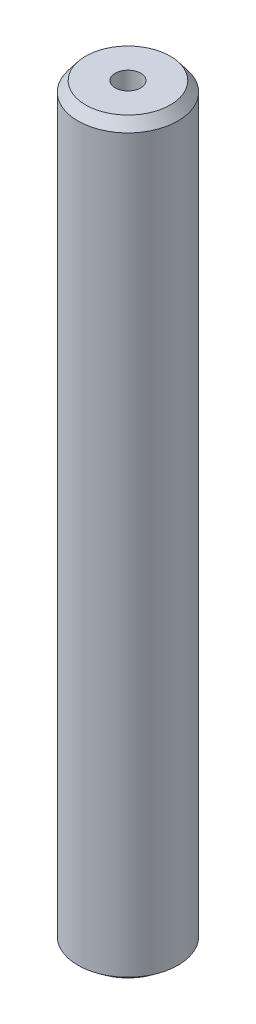
ISO-10303-21;
HEADER;
FILE_DESCRIPTION(('STEP AP214'),'2;1');
FILE_NAME('part.step','',(''),(''),'','','');
FILE_SCHEMA(('AUTOMOTIVE_DESIGN { 1 0 10303 214 1 1 1 1 }'));
ENDSEC;
DATA;
#1=APPLICATION_CONTEXT('core data for automotive mechanical design processes');
#2=APPLICATION_PROTOCOL_DEFINITION('international standard','automotive_design',2000,#1);
#3=PRODUCT_CONTEXT('',#1,'mechanical');
#4=PRODUCT('Part','Part','',(#3));
#5=PRODUCT_RELATED_PRODUCT_CATEGORY('part','',(#4));
#6=PRODUCT_DEFINITION_FORMATION('','',#4);
#7=PRODUCT_DEFINITION_CONTEXT('part definition',#1,'design');
#8=PRODUCT_DEFINITION('design','',#6,#7);
#9=PRODUCT_DEFINITION_SHAPE('','',#8);
#10=(LENGTH_UNIT() NAMED_UNIT(*) SI_UNIT(.MILLI.,.METRE.));
#11=(NAMED_UNIT(*) PLANE_ANGLE_UNIT() SI_UNIT($,.RADIAN.));
#12=(NAMED_UNIT(*) SI_UNIT($,.STERADIAN.) SOLID_ANGLE_UNIT());
#13=UNCERTAINTY_MEASURE_WITH_UNIT(LENGTH_MEASURE(1.E-05),#10,'distance_accuracy_value','');
#14=(GEOMETRIC_REPRESENTATION_CONTEXT(3) GLOBAL_UNCERTAINTY_ASSIGNED_CONTEXT((#13)) GLOBAL_UNIT_ASSIGNED_CONTEXT((#10,
#11,#12)) REPRESENTATION_CONTEXT('',''));
#15=CARTESIAN_POINT('',(0.,0.,0.));
#16=DIRECTION('',(0.,0.,1.));
#17=DIRECTION('',(1.,0.,0.));
#18=AXIS2_PLACEMENT_3D('',#15,#16,#17);
#19=CARTESIAN_POINT('',(0.,74.8394640277143,0.));
#20=DIRECTION('',(0.,-1.,0.));
#21=DIRECTION('',(0.,0.,-1.));
#22=AXIS2_PLACEMENT_3D('',#19,#20,#21);
#23=CYLINDRICAL_SURFACE('',#22,5.);
#24=CARTESIAN_POINT('',(0.,73.8399286942285,0.));
#25=DIRECTION('',(0.,1.,0.));
#26=DIRECTION('',(0.,0.,1.));
#27=AXIS2_PLACEMENT_3D('',#24,#25,#26);
#28=CIRCLE('',#27,5.);
#29=CARTESIAN_POINT('',(0.,73.8399286942285,5.));
#30=VERTEX_POINT('',#29);
#31=EDGE_CURVE('E50',#30,#30,#28,.F.);
#32=ORIENTED_EDGE('',*,*,#31,.T.);
#33=EDGE_LOOP('',(#32));
#34=FACE_BOUND('',#33,.T.);
#35=CARTESIAN_POINT('',(0.,0.771965312745551,0.));
#36=DIRECTION('',(0.,1.,0.));
#37=DIRECTION('',(0.,0.,1.));
#38=AXIS2_PLACEMENT_3D('',#35,#36,#37);
#39=CIRCLE('',#38,5.);
#40=CARTESIAN_POINT('',(0.,0.771965312745551,5.));
#41=VERTEX_POINT('',#40);
#42=EDGE_CURVE('E51',#41,#41,#39,.T.);
#43=ORIENTED_EDGE('',*,*,#42,.T.);
#44=EDGE_LOOP('',(#43));
#45=FACE_BOUND('',#44,.T.);
#46=ADVANCED_FACE('F39',(#34,#45),#23,.T.);
#47=CARTESIAN_POINT('',(0.,74.8394640277143,0.));
#48=DIRECTION('',(0.,1.,0.));
#49=DIRECTION('',(0.,0.,1.));
#50=AXIS2_PLACEMENT_3D('',#47,#48,#49);
#51=PLANE('',#50);
#52=CARTESIAN_POINT('',(0.,74.8394640277143,0.));
#53=DIRECTION('',(0.,1.,0.));
#54=DIRECTION('',(0.,0.,1.));
#55=AXIS2_PLACEMENT_3D('',#52,#53,#54);
#56=CIRCLE('',#55,4.22803468725446);
#57=CARTESIAN_POINT('',(0.,74.8394640277143,4.22803468725446));
#58=VERTEX_POINT('',#57);
#59=EDGE_CURVE('E54',#58,#58,#56,.T.);
#60=ORIENTED_EDGE('',*,*,#59,.T.);
#61=EDGE_LOOP('',(#60));
#62=FACE_BOUND('',#61,.T.);
#63=CARTESIAN_POINT('',(0.,74.8394640277143,0.));
#64=DIRECTION('',(0.,1.,0.));
#65=DIRECTION('',(0.,0.,1.));
#66=AXIS2_PLACEMENT_3D('',#63,#64,#65);
#67=CIRCLE('',#66,1.27487244635311);
#68=CARTESIAN_POINT('',(0.,74.8394640277143,1.27487244635311));
#69=VERTEX_POINT('',#68);
#70=EDGE_CURVE('E58',#69,#69,#67,.T.);
#71=ORIENTED_EDGE('',*,*,#70,.F.);
#72=EDGE_LOOP('',(#71));
#73=FACE_BOUND('',#72,.T.);
#74=ADVANCED_FACE('F69',(#62,#73),#51,.T.);
#75=CARTESIAN_POINT('',(0.,0.,0.));
#76=DIRECTION('',(0.,1.,0.));
#77=DIRECTION('',(0.,0.,1.));
#78=AXIS2_PLACEMENT_3D('',#75,#76,#77);
#79=PLANE('',#78);
#80=CARTESIAN_POINT('',(0.,0.,0.));
#81=DIRECTION('',(0.,1.,0.));
#82=DIRECTION('',(0.,0.,1.));
#83=AXIS2_PLACEMENT_3D('',#80,#81,#82);
#84=CIRCLE('',#83,4.00046466651419);
#85=CARTESIAN_POINT('',(0.,0.,4.00046466651419));
#86=VERTEX_POINT('',#85);
#87=EDGE_CURVE('E10',#86,#86,#84,.F.);
#88=ORIENTED_EDGE('',*,*,#87,.T.);
#89=EDGE_LOOP('',(#88));
#90=FACE_BOUND('',#89,.T.);
#91=CARTESIAN_POINT('',(0.,0.,0.));
#92=DIRECTION('',(0.,1.,0.));
#93=DIRECTION('',(0.,0.,1.));
#94=AXIS2_PLACEMENT_3D('',#91,#92,#93);
#95=CIRCLE('',#94,1.27487244635311);
#96=CARTESIAN_POINT('',(0.,0.,1.27487244635311));
#97=VERTEX_POINT('',#96);
#98=EDGE_CURVE('E63',#97,#97,#95,.T.);
#99=ORIENTED_EDGE('',*,*,#98,.T.);
#100=EDGE_LOOP('',(#99));
#101=FACE_BOUND('',#100,.T.);
#102=ADVANCED_FACE('F75',(#90,#101),#79,.F.);
#103=CARTESIAN_POINT('',(0.,74.8394640277143,0.));
#104=DIRECTION('',(0.,-1.,0.));
#105=DIRECTION('',(0.,0.,-1.));
#106=AXIS2_PLACEMENT_3D('',#103,#104,#105);
#107=CYLINDRICAL_SURFACE('',#106,1.27487244635311);
#108=ORIENTED_EDGE('',*,*,#70,.T.);
#109=EDGE_LOOP('',(#108));
#110=FACE_BOUND('',#109,.T.);
#111=ORIENTED_EDGE('',*,*,#98,.F.);
#112=EDGE_LOOP('',(#111));
#113=FACE_BOUND('',#112,.T.);
#114=ADVANCED_FACE('F70',(#110,#113),#107,.F.);
#115=CARTESIAN_POINT('',(0.,74.8394640277143,0.));
#116=DIRECTION('',(0.,-1.,0.));
#117=DIRECTION('',(0.,0.,-1.));
#118=AXIS2_PLACEMENT_3D('',#115,#116,#117);
#119=CONICAL_SURFACE('',#118,4.22803468725446,0.657636170434445);
#120=ORIENTED_EDGE('',*,*,#31,.F.);
#121=EDGE_LOOP('',(#120));
#122=FACE_BOUND('',#121,.T.);
#123=ORIENTED_EDGE('',*,*,#59,.F.);
#124=EDGE_LOOP('',(#123));
#125=FACE_BOUND('',#124,.T.);
#126=ADVANCED_FACE('F81',(#122,#125),#119,.T.);
#127=CARTESIAN_POINT('',(0.,0.771965312745551,0.));
#128=DIRECTION('',(0.,1.,0.));
#129=DIRECTION('',(0.,0.,1.));
#130=AXIS2_PLACEMENT_3D('',#127,#128,#129);
#131=CONICAL_SURFACE('',#130,5.,0.913160156360446);
#132=ORIENTED_EDGE('',*,*,#87,.F.);
#133=EDGE_LOOP('',(#132));
#134=FACE_BOUND('',#133,.T.);
#135=ORIENTED_EDGE('',*,*,#42,.F.);
#136=EDGE_LOOP('',(#135));
#137=FACE_BOUND('',#136,.T.);
#138=ADVANCED_FACE('F45',(#134,#137),#131,.T.);
#139=CLOSED_SHELL('',(#46,#74,#102,#114,#126,#138));
#140=MANIFOLD_SOLID_BREP('B2',#139);
#141=ADVANCED_BREP_SHAPE_REPRESENTATION('',(#18,#140),#14);
#142=SHAPE_DEFINITION_REPRESENTATION(#9,#141);
ENDSEC;
END-ISO-10303-21;
